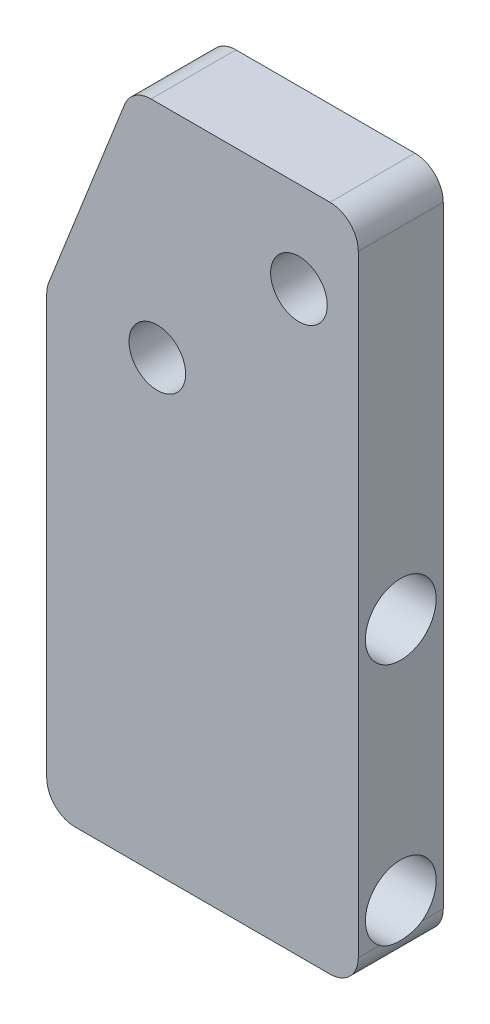
ISO-10303-21;
HEADER;
FILE_DESCRIPTION(('STEP AP214'),'2;1');
FILE_NAME('part.step','',(''),(''),'','','');
FILE_SCHEMA(('AUTOMOTIVE_DESIGN { 1 0 10303 214 1 1 1 1 }'));
ENDSEC;
DATA;
#1=APPLICATION_CONTEXT('core data for automotive mechanical design processes');
#2=APPLICATION_PROTOCOL_DEFINITION('international standard','automotive_design',2000,#1);
#3=PRODUCT_CONTEXT('',#1,'mechanical');
#4=PRODUCT('Part','Part','',(#3));
#5=PRODUCT_RELATED_PRODUCT_CATEGORY('part','',(#4));
#6=PRODUCT_DEFINITION_FORMATION('','',#4);
#7=PRODUCT_DEFINITION_CONTEXT('part definition',#1,'design');
#8=PRODUCT_DEFINITION('design','',#6,#7);
#9=PRODUCT_DEFINITION_SHAPE('','',#8);
#10=(LENGTH_UNIT() NAMED_UNIT(*) SI_UNIT(.MILLI.,.METRE.));
#11=(NAMED_UNIT(*) PLANE_ANGLE_UNIT() SI_UNIT($,.RADIAN.));
#12=(NAMED_UNIT(*) SI_UNIT($,.STERADIAN.) SOLID_ANGLE_UNIT());
#13=UNCERTAINTY_MEASURE_WITH_UNIT(LENGTH_MEASURE(1.E-05),#10,'distance_accuracy_value','');
#14=(GEOMETRIC_REPRESENTATION_CONTEXT(3) GLOBAL_UNCERTAINTY_ASSIGNED_CONTEXT((#13)) GLOBAL_UNIT_ASSIGNED_CONTEXT((#10,
#11,#12)) REPRESENTATION_CONTEXT('',''));
#15=CARTESIAN_POINT('',(0.,0.,0.));
#16=DIRECTION('',(0.,0.,1.));
#17=DIRECTION('',(1.,0.,0.));
#18=AXIS2_PLACEMENT_3D('',#15,#16,#17);
#19=CARTESIAN_POINT('',(-50.8,0.,19.05));
#20=DIRECTION('',(0.,-1.,0.));
#21=DIRECTION('',(0.,0.,-1.));
#22=AXIS2_PLACEMENT_3D('',#19,#20,#21);
#23=PLANE('',#22);
#24=DIRECTION('',(-1.,0.,0.));
#25=VECTOR('',#24,1.);
#26=CARTESIAN_POINT('',(-50.8,0.,0.));
#27=LINE('',#26,#25);
#28=CARTESIAN_POINT('',(-6.35000000000001,0.,0.));
#29=VERTEX_POINT('',#28);
#30=CARTESIAN_POINT('',(-46.4797613857669,0.,0.));
#31=VERTEX_POINT('',#30);
#32=EDGE_CURVE('E142',#29,#31,#27,.T.);
#33=ORIENTED_EDGE('',*,*,#32,.T.);
#34=DIRECTION('',(0.,0.,-1.));
#35=VECTOR('',#34,1.);
#36=CARTESIAN_POINT('',(-46.4797613857669,0.,19.05));
#37=LINE('',#36,#35);
#38=CARTESIAN_POINT('',(-46.4797613857669,0.,19.05));
#39=VERTEX_POINT('',#38);
#40=EDGE_CURVE('E120',#31,#39,#37,.F.);
#41=ORIENTED_EDGE('',*,*,#40,.T.);
#42=DIRECTION('',(-1.,0.,0.));
#43=VECTOR('',#42,1.);
#44=CARTESIAN_POINT('',(-50.8,0.,19.05));
#45=LINE('',#44,#43);
#46=CARTESIAN_POINT('',(-6.35000000000001,0.,19.05));
#47=VERTEX_POINT('',#46);
#48=EDGE_CURVE('E156',#47,#39,#45,.T.);
#49=ORIENTED_EDGE('',*,*,#48,.F.);
#50=DIRECTION('',(0.,0.,-1.));
#51=VECTOR('',#50,1.);
#52=CARTESIAN_POINT('',(-6.35000000000001,0.,19.05));
#53=LINE('',#52,#51);
#54=EDGE_CURVE('E125',#47,#29,#53,.T.);
#55=ORIENTED_EDGE('',*,*,#54,.T.);
#56=EDGE_LOOP('',(#33,#41,#49,#55));
#57=FACE_BOUND('',#56,.T.);
#58=ADVANCED_FACE('F33',(#57),#23,.F.);
#59=CARTESIAN_POINT('',(-69.85,-48.26,19.05));
#60=DIRECTION('',(0.930155221331323,-0.367166534736048,0.));
#61=DIRECTION('',(0.367166534736048,0.930155221331323,0.));
#62=AXIS2_PLACEMENT_3D('',#59,#60,#61);
#63=PLANE('',#62);
#64=DIRECTION('',(-0.367166534736048,-0.930155221331323,0.));
#65=VECTOR('',#64,1.);
#66=CARTESIAN_POINT('',(-69.85,-48.26,19.05));
#67=LINE('',#66,#65);
#68=CARTESIAN_POINT('',(-52.3862470412208,-4.01849250442609,19.05));
#69=VERTEX_POINT('',#68);
#70=CARTESIAN_POINT('',(-69.4064856554539,-47.1364303271499,19.05));
#71=VERTEX_POINT('',#70);
#72=EDGE_CURVE('E135',#69,#71,#67,.T.);
#73=ORIENTED_EDGE('',*,*,#72,.F.);
#74=DIRECTION('',(0.,0.,-1.));
#75=VECTOR('',#74,1.);
#76=CARTESIAN_POINT('',(-52.3862470412208,-4.0184925044261,19.05));
#77=LINE('',#76,#75);
#78=CARTESIAN_POINT('',(-52.3862470412208,-4.01849250442609,0.));
#79=VERTEX_POINT('',#78);
#80=EDGE_CURVE('E119',#69,#79,#77,.T.);
#81=ORIENTED_EDGE('',*,*,#80,.T.);
#82=DIRECTION('',(-0.367166534736048,-0.930155221331323,0.));
#83=VECTOR('',#82,1.);
#84=CARTESIAN_POINT('',(-69.85,-48.26,0.));
#85=LINE('',#84,#83);
#86=CARTESIAN_POINT('',(-69.4064856554539,-47.1364303271499,0.));
#87=VERTEX_POINT('',#86);
#88=EDGE_CURVE('E132',#79,#87,#85,.T.);
#89=ORIENTED_EDGE('',*,*,#88,.T.);
#90=DIRECTION('',(0.,0.,-1.));
#91=VECTOR('',#90,1.);
#92=CARTESIAN_POINT('',(-69.4064856554539,-47.1364303271499,19.05));
#93=LINE('',#92,#91);
#94=EDGE_CURVE('E137',#87,#71,#93,.F.);
#95=ORIENTED_EDGE('',*,*,#94,.T.);
#96=EDGE_LOOP('',(#73,#81,#89,#95));
#97=FACE_BOUND('',#96,.T.);
#98=ADVANCED_FACE('F131',(#97),#63,.F.);
#99=CARTESIAN_POINT('',(-69.85,-149.86,19.05));
#100=DIRECTION('',(1.,0.,0.));
#101=DIRECTION('',(0.,0.,-1.));
#102=AXIS2_PLACEMENT_3D('',#99,#100,#101);
#103=PLANE('',#102);
#104=DIRECTION('',(0.,-1.,0.));
#105=VECTOR('',#104,1.);
#106=CARTESIAN_POINT('',(-69.85,-149.86,0.));
#107=LINE('',#106,#105);
#108=CARTESIAN_POINT('',(-69.85,-49.4679378227238,0.));
#109=VERTEX_POINT('',#108);
#110=CARTESIAN_POINT('',(-69.85,-143.51,0.));
#111=VERTEX_POINT('',#110);
#112=EDGE_CURVE('E141',#109,#111,#107,.T.);
#113=ORIENTED_EDGE('',*,*,#112,.T.);
#114=DIRECTION('',(0.,0.,-1.));
#115=VECTOR('',#114,1.);
#116=CARTESIAN_POINT('',(-69.85,-143.51,19.05));
#117=LINE('',#116,#115);
#118=CARTESIAN_POINT('',(-69.85,-143.51,19.05));
#119=VERTEX_POINT('',#118);
#120=EDGE_CURVE('E11',#111,#119,#117,.F.);
#121=ORIENTED_EDGE('',*,*,#120,.T.);
#122=DIRECTION('',(0.,-1.,0.));
#123=VECTOR('',#122,1.);
#124=CARTESIAN_POINT('',(-69.85,-149.86,19.05));
#125=LINE('',#124,#123);
#126=CARTESIAN_POINT('',(-69.85,-49.4679378227238,19.05));
#127=VERTEX_POINT('',#126);
#128=EDGE_CURVE('E245',#127,#119,#125,.T.);
#129=ORIENTED_EDGE('',*,*,#128,.F.);
#130=DIRECTION('',(0.,0.,-1.));
#131=VECTOR('',#130,1.);
#132=CARTESIAN_POINT('',(-69.85,-49.4679378227238,19.05));
#133=LINE('',#132,#131);
#134=EDGE_CURVE('E41',#127,#109,#133,.T.);
#135=ORIENTED_EDGE('',*,*,#134,.T.);
#136=EDGE_LOOP('',(#113,#121,#129,#135));
#137=FACE_BOUND('',#136,.T.);
#138=ADVANCED_FACE('F217',(#137),#103,.F.);
#139=CARTESIAN_POINT('',(0.,-149.86,19.05));
#140=DIRECTION('',(0.,1.,0.));
#141=DIRECTION('',(0.,0.,1.));
#142=AXIS2_PLACEMENT_3D('',#139,#140,#141);
#143=PLANE('',#142);
#144=DIRECTION('',(1.,0.,0.));
#145=VECTOR('',#144,1.);
#146=CARTESIAN_POINT('',(0.,-149.86,0.));
#147=LINE('',#146,#145);
#148=CARTESIAN_POINT('',(-63.5,-149.86,0.));
#149=VERTEX_POINT('',#148);
#150=CARTESIAN_POINT('',(-6.34999999999998,-149.86,0.));
#151=VERTEX_POINT('',#150);
#152=EDGE_CURVE('E145',#149,#151,#147,.T.);
#153=ORIENTED_EDGE('',*,*,#152,.T.);
#154=DIRECTION('',(0.,0.,-1.));
#155=VECTOR('',#154,1.);
#156=CARTESIAN_POINT('',(-6.34999999999998,-149.86,19.05));
#157=LINE('',#156,#155);
#158=CARTESIAN_POINT('',(-6.34999999999998,-149.86,19.05));
#159=VERTEX_POINT('',#158);
#160=EDGE_CURVE('E262',#151,#159,#157,.F.);
#161=ORIENTED_EDGE('',*,*,#160,.T.);
#162=DIRECTION('',(1.,0.,0.));
#163=VECTOR('',#162,1.);
#164=CARTESIAN_POINT('',(0.,-149.86,19.05));
#165=LINE('',#164,#163);
#166=CARTESIAN_POINT('',(-63.5,-149.86,19.05));
#167=VERTEX_POINT('',#166);
#168=EDGE_CURVE('E253',#167,#159,#165,.T.);
#169=ORIENTED_EDGE('',*,*,#168,.F.);
#170=DIRECTION('',(0.,0.,-1.));
#171=VECTOR('',#170,1.);
#172=CARTESIAN_POINT('',(-63.5,-149.86,19.05));
#173=LINE('',#172,#171);
#174=EDGE_CURVE('E190',#167,#149,#173,.T.);
#175=ORIENTED_EDGE('',*,*,#174,.T.);
#176=EDGE_LOOP('',(#153,#161,#169,#175));
#177=FACE_BOUND('',#176,.T.);
#178=ADVANCED_FACE('F213',(#177),#143,.F.);
#179=CARTESIAN_POINT('',(0.,0.,19.05));
#180=DIRECTION('',(-1.,0.,0.));
#181=DIRECTION('',(0.,-1.,0.));
#182=AXIS2_PLACEMENT_3D('',#179,#180,#181);
#183=PLANE('',#182);
#184=CARTESIAN_POINT('',(0.,-82.55,9.525));
#185=DIRECTION('',(1.,0.,0.));
#186=DIRECTION('',(0.,0.,-1.));
#187=AXIS2_PLACEMENT_3D('',#184,#185,#186);
#188=CIRCLE('',#187,7.9375);
#189=CARTESIAN_POINT('',(0.,-82.55,1.5875));
#190=VERTEX_POINT('',#189);
#191=EDGE_CURVE('E267',#190,#190,#188,.T.);
#192=ORIENTED_EDGE('',*,*,#191,.F.);
#193=EDGE_LOOP('',(#192));
#194=FACE_BOUND('',#193,.T.);
#195=DIRECTION('',(0.,1.,0.));
#196=VECTOR('',#195,1.);
#197=CARTESIAN_POINT('',(0.,0.,0.));
#198=LINE('',#197,#196);
#199=CARTESIAN_POINT('',(0.,-143.51,0.));
#200=VERTEX_POINT('',#199);
#201=CARTESIAN_POINT('',(0.,-6.35,0.));
#202=VERTEX_POINT('',#201);
#203=EDGE_CURVE('E153',#200,#202,#198,.T.);
#204=ORIENTED_EDGE('',*,*,#203,.T.);
#205=DIRECTION('',(0.,0.,-1.));
#206=VECTOR('',#205,1.);
#207=CARTESIAN_POINT('',(0.,-6.35,19.05));
#208=LINE('',#207,#206);
#209=CARTESIAN_POINT('',(0.,-6.35,19.05));
#210=VERTEX_POINT('',#209);
#211=EDGE_CURVE('E182',#202,#210,#208,.F.);
#212=ORIENTED_EDGE('',*,*,#211,.T.);
#213=DIRECTION('',(0.,1.,0.));
#214=VECTOR('',#213,1.);
#215=CARTESIAN_POINT('',(0.,0.,19.05));
#216=LINE('',#215,#214);
#217=CARTESIAN_POINT('',(0.,-143.51,19.05));
#218=VERTEX_POINT('',#217);
#219=EDGE_CURVE('E157',#218,#210,#216,.T.);
#220=ORIENTED_EDGE('',*,*,#219,.F.);
#221=DIRECTION('',(0.,0.,-1.));
#222=VECTOR('',#221,1.);
#223=CARTESIAN_POINT('',(0.,-143.51,19.05));
#224=LINE('',#223,#222);
#225=CARTESIAN_POINT('',(0.,-143.51,14.2875000000001));
#226=VERTEX_POINT('',#225);
#227=EDGE_CURVE('E180',#218,#226,#224,.T.);
#228=ORIENTED_EDGE('',*,*,#227,.T.);
#229=CARTESIAN_POINT('',(0.,-137.16,9.525));
#230=DIRECTION('',(1.,0.,0.));
#231=DIRECTION('',(0.,0.,-1.));
#232=AXIS2_PLACEMENT_3D('',#229,#230,#231);
#233=CIRCLE('',#232,7.93750000000001);
#234=CARTESIAN_POINT('',(0.,-143.51,4.76249999999994));
#235=VERTEX_POINT('',#234);
#236=EDGE_CURVE('E248',#235,#226,#233,.T.);
#237=ORIENTED_EDGE('',*,*,#236,.F.);
#238=DIRECTION('',(0.,0.,-1.));
#239=VECTOR('',#238,1.);
#240=CARTESIAN_POINT('',(0.,-143.51,19.05));
#241=LINE('',#240,#239);
#242=EDGE_CURVE('E178',#235,#200,#241,.T.);
#243=ORIENTED_EDGE('',*,*,#242,.T.);
#244=EDGE_LOOP('',(#204,#212,#220,#228,#237,#243));
#245=FACE_BOUND('',#244,.T.);
#246=ADVANCED_FACE('F206',(#194,#245),#183,.F.);
#247=CARTESIAN_POINT('',(0.,0.,19.05));
#248=DIRECTION('',(0.,0.,-1.));
#249=DIRECTION('',(-1.,0.,0.));
#250=AXIS2_PLACEMENT_3D('',#247,#248,#249);
#251=PLANE('',#250);
#252=CARTESIAN_POINT('',(-45.0596,-49.53,19.05));
#253=DIRECTION('',(0.,0.,1.));
#254=DIRECTION('',(1.,0.,0.));
#255=AXIS2_PLACEMENT_3D('',#252,#253,#254);
#256=CIRCLE('',#255,6.35);
#257=CARTESIAN_POINT('',(-38.7096,-49.53,19.05));
#258=VERTEX_POINT('',#257);
#259=EDGE_CURVE('E269',#258,#258,#256,.T.);
#260=ORIENTED_EDGE('',*,*,#259,.F.);
#261=EDGE_LOOP('',(#260));
#262=FACE_BOUND('',#261,.T.);
#263=CARTESIAN_POINT('',(-13.3096,-20.32,19.05));
#264=DIRECTION('',(0.,0.,1.));
#265=DIRECTION('',(1.,0.,0.));
#266=AXIS2_PLACEMENT_3D('',#263,#264,#265);
#267=CIRCLE('',#266,6.35000000000001);
#268=CARTESIAN_POINT('',(-6.95959999999998,-20.32,19.05));
#269=VERTEX_POINT('',#268);
#270=EDGE_CURVE('E278',#269,#269,#267,.T.);
#271=ORIENTED_EDGE('',*,*,#270,.F.);
#272=EDGE_LOOP('',(#271));
#273=FACE_BOUND('',#272,.T.);
#274=ORIENTED_EDGE('',*,*,#48,.T.);
#275=CARTESIAN_POINT('',(-46.4797613857669,-6.35,19.05));
#276=DIRECTION('',(0.,0.,-1.));
#277=DIRECTION('',(-1.,0.,0.));
#278=AXIS2_PLACEMENT_3D('',#275,#276,#277);
#279=CIRCLE('',#278,6.35);
#280=EDGE_CURVE('E176',#39,#69,#279,.F.);
#281=ORIENTED_EDGE('',*,*,#280,.T.);
#282=ORIENTED_EDGE('',*,*,#72,.T.);
#283=CARTESIAN_POINT('',(-63.5,-49.4679378227238,19.05));
#284=DIRECTION('',(0.,0.,-1.));
#285=DIRECTION('',(-1.,0.,0.));
#286=AXIS2_PLACEMENT_3D('',#283,#284,#285);
#287=CIRCLE('',#286,6.35);
#288=EDGE_CURVE('E168',#71,#127,#287,.F.);
#289=ORIENTED_EDGE('',*,*,#288,.T.);
#290=ORIENTED_EDGE('',*,*,#128,.T.);
#291=CARTESIAN_POINT('',(-63.5,-143.51,19.05));
#292=DIRECTION('',(0.,0.,-1.));
#293=DIRECTION('',(-1.,0.,0.));
#294=AXIS2_PLACEMENT_3D('',#291,#292,#293);
#295=CIRCLE('',#294,6.35);
#296=EDGE_CURVE('E170',#119,#167,#295,.F.);
#297=ORIENTED_EDGE('',*,*,#296,.T.);
#298=ORIENTED_EDGE('',*,*,#168,.T.);
#299=CARTESIAN_POINT('',(-6.34999999999998,-143.51,19.05));
#300=DIRECTION('',(0.,0.,-1.));
#301=DIRECTION('',(-1.,0.,0.));
#302=AXIS2_PLACEMENT_3D('',#299,#300,#301);
#303=CIRCLE('',#302,6.35);
#304=EDGE_CURVE('E172',#159,#218,#303,.F.);
#305=ORIENTED_EDGE('',*,*,#304,.T.);
#306=ORIENTED_EDGE('',*,*,#219,.T.);
#307=CARTESIAN_POINT('',(-6.35000000000001,-6.35,19.05));
#308=DIRECTION('',(0.,0.,-1.));
#309=DIRECTION('',(-1.,0.,0.));
#310=AXIS2_PLACEMENT_3D('',#307,#308,#309);
#311=CIRCLE('',#310,6.35);
#312=EDGE_CURVE('E174',#210,#47,#311,.F.);
#313=ORIENTED_EDGE('',*,*,#312,.T.);
#314=EDGE_LOOP('',(#274,#281,#282,#289,#290,#297,#298,#305,#306,#313));
#315=FACE_BOUND('',#314,.T.);
#316=ADVANCED_FACE('F203',(#262,#273,#315),#251,.F.);
#317=CARTESIAN_POINT('',(0.,0.,0.));
#318=DIRECTION('',(0.,0.,-1.));
#319=DIRECTION('',(-1.,0.,0.));
#320=AXIS2_PLACEMENT_3D('',#317,#318,#319);
#321=PLANE('',#320);
#322=CARTESIAN_POINT('',(-45.0596,-49.53,0.));
#323=DIRECTION('',(0.,0.,1.));
#324=DIRECTION('',(1.,0.,0.));
#325=AXIS2_PLACEMENT_3D('',#322,#323,#324);
#326=CIRCLE('',#325,6.35);
#327=CARTESIAN_POINT('',(-38.7096,-49.53,0.));
#328=VERTEX_POINT('',#327);
#329=EDGE_CURVE('E265',#328,#328,#326,.T.);
#330=ORIENTED_EDGE('',*,*,#329,.T.);
#331=EDGE_LOOP('',(#330));
#332=FACE_BOUND('',#331,.T.);
#333=CARTESIAN_POINT('',(-13.3096,-20.32,0.));
#334=DIRECTION('',(0.,0.,1.));
#335=DIRECTION('',(1.,0.,0.));
#336=AXIS2_PLACEMENT_3D('',#333,#334,#335);
#337=CIRCLE('',#336,6.35000000000001);
#338=CARTESIAN_POINT('',(-6.95959999999998,-20.32,0.));
#339=VERTEX_POINT('',#338);
#340=EDGE_CURVE('E273',#339,#339,#337,.T.);
#341=ORIENTED_EDGE('',*,*,#340,.T.);
#342=EDGE_LOOP('',(#341));
#343=FACE_BOUND('',#342,.T.);
#344=ORIENTED_EDGE('',*,*,#88,.F.);
#345=CARTESIAN_POINT('',(-46.4797613857669,-6.35,0.));
#346=DIRECTION('',(0.,0.,-1.));
#347=DIRECTION('',(-1.,0.,0.));
#348=AXIS2_PLACEMENT_3D('',#345,#346,#347);
#349=CIRCLE('',#348,6.35);
#350=EDGE_CURVE('E115',#79,#31,#349,.T.);
#351=ORIENTED_EDGE('',*,*,#350,.T.);
#352=ORIENTED_EDGE('',*,*,#32,.F.);
#353=CARTESIAN_POINT('',(-6.35000000000001,-6.35,0.));
#354=DIRECTION('',(0.,0.,-1.));
#355=DIRECTION('',(-1.,0.,0.));
#356=AXIS2_PLACEMENT_3D('',#353,#354,#355);
#357=CIRCLE('',#356,6.35);
#358=EDGE_CURVE('E126',#29,#202,#357,.T.);
#359=ORIENTED_EDGE('',*,*,#358,.T.);
#360=ORIENTED_EDGE('',*,*,#203,.F.);
#361=CARTESIAN_POINT('',(-6.34999999999998,-143.51,0.));
#362=DIRECTION('',(0.,0.,-1.));
#363=DIRECTION('',(-1.,0.,0.));
#364=AXIS2_PLACEMENT_3D('',#361,#362,#363);
#365=CIRCLE('',#364,6.35);
#366=EDGE_CURVE('E162',#200,#151,#365,.T.);
#367=ORIENTED_EDGE('',*,*,#366,.T.);
#368=ORIENTED_EDGE('',*,*,#152,.F.);
#369=CARTESIAN_POINT('',(-63.5,-143.51,0.));
#370=DIRECTION('',(0.,0.,-1.));
#371=DIRECTION('',(-1.,0.,0.));
#372=AXIS2_PLACEMENT_3D('',#369,#370,#371);
#373=CIRCLE('',#372,6.35);
#374=EDGE_CURVE('E160',#149,#111,#373,.T.);
#375=ORIENTED_EDGE('',*,*,#374,.T.);
#376=ORIENTED_EDGE('',*,*,#112,.F.);
#377=CARTESIAN_POINT('',(-63.5,-49.4679378227238,0.));
#378=DIRECTION('',(0.,0.,-1.));
#379=DIRECTION('',(-1.,0.,0.));
#380=AXIS2_PLACEMENT_3D('',#377,#378,#379);
#381=CIRCLE('',#380,6.35);
#382=EDGE_CURVE('E136',#109,#87,#381,.T.);
#383=ORIENTED_EDGE('',*,*,#382,.T.);
#384=EDGE_LOOP('',(#344,#351,#352,#359,#360,#367,#368,#375,#376,#383));
#385=FACE_BOUND('',#384,.T.);
#386=ADVANCED_FACE('F139',(#332,#343,#385),#321,.T.);
#387=CARTESIAN_POINT('',(-15.24,-137.16,9.525));
#388=DIRECTION('',(1.,0.,0.));
#389=DIRECTION('',(0.,0.,-1.));
#390=AXIS2_PLACEMENT_3D('',#387,#388,#389);
#391=CYLINDRICAL_SURFACE('',#390,7.93750000000001);
#392=CARTESIAN_POINT('',(-15.24,-137.16,9.525));
#393=DIRECTION('',(1.,0.,0.));
#394=DIRECTION('',(0.,0.,-1.));
#395=AXIS2_PLACEMENT_3D('',#392,#393,#394);
#396=CIRCLE('',#395,7.93750000000001);
#397=CARTESIAN_POINT('',(-15.24,-137.16,1.58749999999999));
#398=VERTEX_POINT('',#397);
#399=EDGE_CURVE('E264',#398,#398,#396,.T.);
#400=ORIENTED_EDGE('',*,*,#399,.F.);
#401=EDGE_LOOP('',(#400));
#402=FACE_BOUND('',#401,.T.);
#403=ORIENTED_EDGE('',*,*,#236,.T.);
#404=CARTESIAN_POINT('',(0.,-143.51,14.2875000000001));
#405=CARTESIAN_POINT('',(-3.44369659539257E-05,-143.642536186943,14.1108252005884));
#406=CARTESIAN_POINT('',(-0.00414976258488821,-143.767610469502,13.928657903944));
#407=CARTESIAN_POINT('',(-0.0179940706033077,-144.002031418874,13.5547730810565));
#408=CARTESIAN_POINT('',(-0.0277205398448881,-144.111385099366,13.3630598654057));
#409=CARTESIAN_POINT('',(-0.0502524148812657,-144.313760173317,12.9712041278514));
#410=CARTESIAN_POINT('',(-0.0630602244612766,-144.406768717257,12.771055126148));
#411=CARTESIAN_POINT('',(-0.0894968024420439,-144.575799715155,12.3637383759874));
#412=CARTESIAN_POINT('',(-0.103125651724309,-144.651820492145,12.1565699369203));
#413=CARTESIAN_POINT('',(-0.129218492774142,-144.786351848128,11.73662013719));
#414=CARTESIAN_POINT('',(-0.14168284408831,-144.84486784421,11.5238405352026));
#415=CARTESIAN_POINT('',(-0.16382888465419,-144.944005662014,11.0940128038307));
#416=CARTESIAN_POINT('',(-0.173510687111791,-144.984628211752,10.8769648484848));
#417=CARTESIAN_POINT('',(-0.188890664730627,-145.04762336953,10.4403629454708));
#418=CARTESIAN_POINT('',(-0.19459370720049,-145.07001828147,10.2208123948039));
#419=CARTESIAN_POINT('',(-0.201352610691082,-145.096450055665,9.78053729918798));
#420=CARTESIAN_POINT('',(-0.202408539522986,-145.100487185799,9.55981277141681));
#421=CARTESIAN_POINT('',(-0.199757153640529,-145.090202232469,9.12026232648755));
#422=CARTESIAN_POINT('',(-0.196080826158967,-145.075999586075,8.90143340848484));
#423=CARTESIAN_POINT('',(-0.184450467309995,-145.029562079755,8.46581055025538));
#424=CARTESIAN_POINT('',(-0.176496323814706,-144.997326747164,8.24901666352137));
#425=CARTESIAN_POINT('',(-0.157251768333759,-144.915044899653,7.81877417491315));
#426=CARTESIAN_POINT('',(-0.145958091966857,-144.864980947491,7.6053290624397));
#427=CARTESIAN_POINT('',(-0.121444151532684,-144.747414282074,7.18341840537624));
#428=CARTESIAN_POINT('',(-0.108223973693764,-144.679912349221,6.97495263840133));
#429=CARTESIAN_POINT('',(-0.0833315690905217,-144.537567098085,6.59038690496283));
#430=CARTESIAN_POINT('',(-0.0716757025503444,-144.464741107551,6.41353566321931));
#431=CARTESIAN_POINT('',(-0.0496449227174874,-144.306494225554,6.06551141135136));
#432=CARTESIAN_POINT('',(-0.0392697609635036,-144.221075784151,5.89433730456983));
#433=CARTESIAN_POINT('',(-0.0213354398683445,-144.038157483597,5.55872903477563));
#434=CARTESIAN_POINT('',(-0.0137721826433725,-143.940675483623,5.39428537697624));
#435=CARTESIAN_POINT('',(-0.00311275890815958,-143.733994182021,5.0726835041843));
#436=CARTESIAN_POINT('',(-1.86583923561734E-05,-143.624789486289,4.91552869113696));
#437=CARTESIAN_POINT('',(0.,-143.51,4.76249999999994));
#438=B_SPLINE_CURVE_WITH_KNOTS('',3,(#404,#405,#406,#407,#408,#409,#410,#411,#412,#413,#414,
#415,#416,#417,#418,#419,#420,#421,#422,#423,#424,#425,#426,#427,#428,#429,#430,#431,#432,#433,
#434,#435,#436,#437),.UNSPECIFIED.,.F.,.F.,(4,2,2,2,2,2,2,2,2,2,2,2,2,2,2,2,4),(0.,
0.662238198725864,1.32418001964152,1.98663991221459,2.64916517148288,3.31148519086149,
3.97377826043703,4.63525970424038,5.29673149560434,5.95389386506592,6.61107346056394,
7.26889758233349,7.92669226956654,8.50104826461327,9.07529265683374,9.64869687200624,
10.2223660747974),.UNSPECIFIED.);
#439=EDGE_CURVE('E47',#226,#235,#438,.T.);
#440=ORIENTED_EDGE('',*,*,#439,.T.);
#441=EDGE_LOOP('',(#403,#440));
#442=FACE_BOUND('',#441,.T.);
#443=ADVANCED_FACE('F195',(#402,#442),#391,.F.);
#444=CARTESIAN_POINT('',(-15.24,-137.16,9.525));
#445=DIRECTION('',(1.,0.,0.));
#446=DIRECTION('',(0.,0.,-1.));
#447=AXIS2_PLACEMENT_3D('',#444,#445,#446);
#448=PLANE('',#447);
#449=ORIENTED_EDGE('',*,*,#399,.T.);
#450=EDGE_LOOP('',(#449));
#451=FACE_BOUND('',#450,.T.);
#452=ADVANCED_FACE('F200',(#451),#448,.T.);
#453=CARTESIAN_POINT('',(-15.24,-82.55,9.525));
#454=DIRECTION('',(1.,0.,0.));
#455=DIRECTION('',(0.,0.,-1.));
#456=AXIS2_PLACEMENT_3D('',#453,#454,#455);
#457=CYLINDRICAL_SURFACE('',#456,7.9375);
#458=CARTESIAN_POINT('',(-15.24,-82.55,9.525));
#459=DIRECTION('',(1.,0.,0.));
#460=DIRECTION('',(0.,0.,-1.));
#461=AXIS2_PLACEMENT_3D('',#458,#459,#460);
#462=CIRCLE('',#461,7.9375);
#463=CARTESIAN_POINT('',(-15.24,-82.55,1.5875));
#464=VERTEX_POINT('',#463);
#465=EDGE_CURVE('E147',#464,#464,#462,.T.);
#466=CARTESIAN_POINT('',(-15.24,-82.55,1.5875));
#467=CARTESIAN_POINT('',(-15.08125,-82.55,1.5875));
#468=CARTESIAN_POINT('',(-14.9225,-82.55,1.5875));
#469=CARTESIAN_POINT('',(-14.605,-82.55,1.5875));
#470=CARTESIAN_POINT('',(-14.44625,-82.55,1.5875));
#471=CARTESIAN_POINT('',(-14.12875,-82.55,1.5875));
#472=CARTESIAN_POINT('',(-13.97,-82.55,1.5875));
#473=CARTESIAN_POINT('',(-13.6525,-82.55,1.5875));
#474=CARTESIAN_POINT('',(-13.49375,-82.55,1.5875));
#475=CARTESIAN_POINT('',(-13.17625,-82.55,1.5875));
#476=CARTESIAN_POINT('',(-13.0175,-82.55,1.5875));
#477=CARTESIAN_POINT('',(-12.7,-82.55,1.5875));
#478=CARTESIAN_POINT('',(-12.54125,-82.55,1.5875));
#479=CARTESIAN_POINT('',(-12.22375,-82.55,1.5875));
#480=CARTESIAN_POINT('',(-12.065,-82.55,1.5875));
#481=CARTESIAN_POINT('',(-11.7475,-82.55,1.5875));
#482=CARTESIAN_POINT('',(-11.58875,-82.55,1.5875));
#483=CARTESIAN_POINT('',(-11.27125,-82.55,1.5875));
#484=CARTESIAN_POINT('',(-11.1125,-82.55,1.5875));
#485=CARTESIAN_POINT('',(-10.795,-82.55,1.5875));
#486=CARTESIAN_POINT('',(-10.63625,-82.55,1.5875));
#487=CARTESIAN_POINT('',(-10.31875,-82.55,1.5875));
#488=CARTESIAN_POINT('',(-10.16,-82.55,1.5875));
#489=CARTESIAN_POINT('',(-9.8425,-82.55,1.5875));
#490=CARTESIAN_POINT('',(-9.68375,-82.55,1.5875));
#491=CARTESIAN_POINT('',(-9.36625,-82.55,1.5875));
#492=CARTESIAN_POINT('',(-9.2075,-82.55,1.5875));
#493=CARTESIAN_POINT('',(-8.89,-82.55,1.5875));
#494=CARTESIAN_POINT('',(-8.73125,-82.55,1.5875));
#495=CARTESIAN_POINT('',(-8.41375,-82.55,1.5875));
#496=CARTESIAN_POINT('',(-8.255,-82.55,1.5875));
#497=CARTESIAN_POINT('',(-7.9375,-82.55,1.5875));
#498=CARTESIAN_POINT('',(-7.77875,-82.55,1.5875));
#499=CARTESIAN_POINT('',(-7.46125,-82.55,1.5875));
#500=CARTESIAN_POINT('',(-7.3025,-82.55,1.5875));
#501=CARTESIAN_POINT('',(-6.985,-82.55,1.5875));
#502=CARTESIAN_POINT('',(-6.82625,-82.55,1.5875));
#503=CARTESIAN_POINT('',(-6.50875,-82.55,1.5875));
#504=CARTESIAN_POINT('',(-6.35,-82.55,1.5875));
#505=CARTESIAN_POINT('',(-6.0325,-82.55,1.5875));
#506=CARTESIAN_POINT('',(-5.87375,-82.55,1.5875));
#507=CARTESIAN_POINT('',(-5.55625,-82.55,1.5875));
#508=CARTESIAN_POINT('',(-5.3975,-82.55,1.5875));
#509=CARTESIAN_POINT('',(-5.08,-82.55,1.5875));
#510=CARTESIAN_POINT('',(-4.92125,-82.55,1.5875));
#511=CARTESIAN_POINT('',(-4.60375,-82.55,1.5875));
#512=CARTESIAN_POINT('',(-4.445,-82.55,1.5875));
#513=CARTESIAN_POINT('',(-4.1275,-82.55,1.5875));
#514=CARTESIAN_POINT('',(-3.96875,-82.55,1.5875));
#515=CARTESIAN_POINT('',(-3.65125,-82.55,1.5875));
#516=CARTESIAN_POINT('',(-3.4925,-82.55,1.5875));
#517=CARTESIAN_POINT('',(-3.175,-82.55,1.5875));
#518=CARTESIAN_POINT('',(-3.01625,-82.55,1.5875));
#519=CARTESIAN_POINT('',(-2.69875,-82.55,1.5875));
#520=CARTESIAN_POINT('',(-2.54,-82.55,1.5875));
#521=CARTESIAN_POINT('',(-2.2225,-82.55,1.5875));
#522=CARTESIAN_POINT('',(-2.06375,-82.55,1.5875));
#523=CARTESIAN_POINT('',(-1.74625,-82.55,1.5875));
#524=CARTESIAN_POINT('',(-1.5875,-82.55,1.5875));
#525=CARTESIAN_POINT('',(-1.27,-82.55,1.5875));
#526=CARTESIAN_POINT('',(-1.11125,-82.55,1.5875));
#527=CARTESIAN_POINT('',(-0.79375,-82.55,1.5875));
#528=CARTESIAN_POINT('',(-0.634999999999999,-82.55,1.5875));
#529=CARTESIAN_POINT('',(-0.3175,-82.55,1.5875));
#530=CARTESIAN_POINT('',(-0.15875,-82.55,1.5875));
#531=CARTESIAN_POINT('',(0.,-82.55,1.5875));
#532=B_SPLINE_CURVE_WITH_KNOTS('',3,(#466,#467,#468,#469,#470,#471,#472,#473,#474,#475,#476,
#477,#478,#479,#480,#481,#482,#483,#484,#485,#486,#487,#488,#489,#490,#491,#492,#493,#494,#495,
#496,#497,#498,#499,#500,#501,#502,#503,#504,#505,#506,#507,#508,#509,#510,#511,#512,#513,#514,
#515,#516,#517,#518,#519,#520,#521,#522,#523,#524,#525,#526,#527,#528,#529,#530,#531),
.UNSPECIFIED.,.F.,.F.,(4,2,2,2,2,2,2,2,2,2,2,2,2,2,2,2,2,2,2,2,2,2,2,2,2,2,2,2,2,2,2,2,4),(0.,
0.476250000000001,0.9525,1.42875,1.905,2.38125,2.8575,3.33375,3.81,4.28625,4.7625,5.23875,5.715,
6.19125,6.6675,7.14375,7.62,8.09625,8.5725,9.04875,9.525,10.00125,10.4775,10.95375,11.43,
11.90625,12.3825,12.85875,13.335,13.81125,14.2875,14.76375,15.24),.UNSPECIFIED.);
#533=EDGE_CURVE('BSEAM286',#464,#190,#532,.T.);
#534=ORIENTED_EDGE('',*,*,#465,.F.);
#535=ORIENTED_EDGE('',*,*,#191,.T.);
#536=ORIENTED_EDGE('',*,*,#533,.T.);
#537=ORIENTED_EDGE('',*,*,#533,.F.);
#538=EDGE_LOOP('',(#534,#536,#535,#537));
#539=FACE_BOUND('',#538,.T.);
#540=ADVANCED_FACE('F286',(#539),#457,.F.);
#541=CARTESIAN_POINT('',(-15.24,-82.55,9.525));
#542=DIRECTION('',(1.,0.,0.));
#543=DIRECTION('',(0.,0.,-1.));
#544=AXIS2_PLACEMENT_3D('',#541,#542,#543);
#545=PLANE('',#544);
#546=ORIENTED_EDGE('',*,*,#465,.T.);
#547=EDGE_LOOP('',(#546));
#548=FACE_BOUND('',#547,.T.);
#549=ADVANCED_FACE('F288',(#548),#545,.T.);
#550=CARTESIAN_POINT('',(-13.3096,-20.32,0.));
#551=DIRECTION('',(0.,0.,1.));
#552=DIRECTION('',(1.,0.,0.));
#553=AXIS2_PLACEMENT_3D('',#550,#551,#552);
#554=CYLINDRICAL_SURFACE('',#553,6.35000000000001);
#555=CARTESIAN_POINT('',(-6.95959999999998,-20.32,0.));
#556=CARTESIAN_POINT('',(-6.95959999999998,-20.32,0.1984375));
#557=CARTESIAN_POINT('',(-6.95959999999998,-20.32,0.396875));
#558=CARTESIAN_POINT('',(-6.95959999999998,-20.32,0.79375));
#559=CARTESIAN_POINT('',(-6.95959999999998,-20.32,0.9921875));
#560=CARTESIAN_POINT('',(-6.95959999999998,-20.32,1.3890625));
#561=CARTESIAN_POINT('',(-6.95959999999998,-20.32,1.5875));
#562=CARTESIAN_POINT('',(-6.95959999999998,-20.32,1.984375));
#563=CARTESIAN_POINT('',(-6.95959999999998,-20.32,2.1828125));
#564=CARTESIAN_POINT('',(-6.95959999999998,-20.32,2.5796875));
#565=CARTESIAN_POINT('',(-6.95959999999998,-20.32,2.778125));
#566=CARTESIAN_POINT('',(-6.95959999999998,-20.32,3.175));
#567=CARTESIAN_POINT('',(-6.95959999999998,-20.32,3.3734375));
#568=CARTESIAN_POINT('',(-6.95959999999998,-20.32,3.7703125));
#569=CARTESIAN_POINT('',(-6.95959999999998,-20.32,3.96875));
#570=CARTESIAN_POINT('',(-6.95959999999998,-20.32,4.365625));
#571=CARTESIAN_POINT('',(-6.95959999999998,-20.32,4.5640625));
#572=CARTESIAN_POINT('',(-6.95959999999998,-20.32,4.9609375));
#573=CARTESIAN_POINT('',(-6.95959999999998,-20.32,5.159375));
#574=CARTESIAN_POINT('',(-6.95959999999998,-20.32,5.55625));
#575=CARTESIAN_POINT('',(-6.95959999999998,-20.32,5.7546875));
#576=CARTESIAN_POINT('',(-6.95959999999998,-20.32,6.1515625));
#577=CARTESIAN_POINT('',(-6.95959999999998,-20.32,6.35));
#578=CARTESIAN_POINT('',(-6.95959999999998,-20.32,6.746875));
#579=CARTESIAN_POINT('',(-6.95959999999998,-20.32,6.9453125));
#580=CARTESIAN_POINT('',(-6.95959999999998,-20.32,7.3421875));
#581=CARTESIAN_POINT('',(-6.95959999999998,-20.32,7.540625));
#582=CARTESIAN_POINT('',(-6.95959999999998,-20.32,7.9375));
#583=CARTESIAN_POINT('',(-6.95959999999998,-20.32,8.1359375));
#584=CARTESIAN_POINT('',(-6.95959999999998,-20.32,8.5328125));
#585=CARTESIAN_POINT('',(-6.95959999999998,-20.32,8.73125));
#586=CARTESIAN_POINT('',(-6.95959999999998,-20.32,9.128125));
#587=CARTESIAN_POINT('',(-6.95959999999998,-20.32,9.3265625));
#588=CARTESIAN_POINT('',(-6.95959999999998,-20.32,9.7234375));
#589=CARTESIAN_POINT('',(-6.95959999999998,-20.32,9.921875));
#590=CARTESIAN_POINT('',(-6.95959999999998,-20.32,10.31875));
#591=CARTESIAN_POINT('',(-6.95959999999998,-20.32,10.5171875));
#592=CARTESIAN_POINT('',(-6.95959999999998,-20.32,10.9140625));
#593=CARTESIAN_POINT('',(-6.95959999999998,-20.32,11.1125));
#594=CARTESIAN_POINT('',(-6.95959999999998,-20.32,11.509375));
#595=CARTESIAN_POINT('',(-6.95959999999998,-20.32,11.7078125));
#596=CARTESIAN_POINT('',(-6.95959999999998,-20.32,12.1046875));
#597=CARTESIAN_POINT('',(-6.95959999999998,-20.32,12.303125));
#598=CARTESIAN_POINT('',(-6.95959999999998,-20.32,12.7));
#599=CARTESIAN_POINT('',(-6.95959999999998,-20.32,12.8984375));
#600=CARTESIAN_POINT('',(-6.95959999999998,-20.32,13.2953125));
#601=CARTESIAN_POINT('',(-6.95959999999998,-20.32,13.49375));
#602=CARTESIAN_POINT('',(-6.95959999999998,-20.32,13.890625));
#603=CARTESIAN_POINT('',(-6.95959999999998,-20.32,14.0890625));
#604=CARTESIAN_POINT('',(-6.95959999999998,-20.32,14.4859375));
#605=CARTESIAN_POINT('',(-6.95959999999998,-20.32,14.684375));
#606=CARTESIAN_POINT('',(-6.95959999999998,-20.32,15.08125));
#607=CARTESIAN_POINT('',(-6.95959999999998,-20.32,15.2796875));
#608=CARTESIAN_POINT('',(-6.95959999999998,-20.32,15.6765625));
#609=CARTESIAN_POINT('',(-6.95959999999998,-20.32,15.875));
#610=CARTESIAN_POINT('',(-6.95959999999998,-20.32,16.271875));
#611=CARTESIAN_POINT('',(-6.95959999999998,-20.32,16.4703125));
#612=CARTESIAN_POINT('',(-6.95959999999998,-20.32,16.8671875));
#613=CARTESIAN_POINT('',(-6.95959999999998,-20.32,17.065625));
#614=CARTESIAN_POINT('',(-6.95959999999998,-20.32,17.4625));
#615=CARTESIAN_POINT('',(-6.95959999999998,-20.32,17.6609375));
#616=CARTESIAN_POINT('',(-6.95959999999998,-20.32,18.0578125));
#617=CARTESIAN_POINT('',(-6.95959999999998,-20.32,18.25625));
#618=CARTESIAN_POINT('',(-6.95959999999998,-20.32,18.653125));
#619=CARTESIAN_POINT('',(-6.95959999999998,-20.32,18.8515625));
#620=CARTESIAN_POINT('',(-6.95959999999998,-20.32,19.05));
#621=B_SPLINE_CURVE_WITH_KNOTS('',3,(#555,#556,#557,#558,#559,#560,#561,#562,#563,#564,#565,
#566,#567,#568,#569,#570,#571,#572,#573,#574,#575,#576,#577,#578,#579,#580,#581,#582,#583,#584,
#585,#586,#587,#588,#589,#590,#591,#592,#593,#594,#595,#596,#597,#598,#599,#600,#601,#602,#603,
#604,#605,#606,#607,#608,#609,#610,#611,#612,#613,#614,#615,#616,#617,#618,#619,#620),
.UNSPECIFIED.,.F.,.F.,(4,2,2,2,2,2,2,2,2,2,2,2,2,2,2,2,2,2,2,2,2,2,2,2,2,2,2,2,2,2,2,2,4),(0.,
0.5953125,1.190625,1.7859375,2.38125,2.9765625,3.571875,4.1671875,4.7625,5.3578125,5.953125,
6.5484375,7.14375,7.7390625,8.334375,8.9296875,9.525,10.1203125,10.715625,11.3109375,11.90625,
12.5015625,13.096875,13.6921875,14.2875,14.8828125,15.478125,16.0734375,16.66875,17.2640625,
17.859375,18.4546875,19.05),.UNSPECIFIED.);
#622=EDGE_CURVE('BSEAM294',#339,#269,#621,.T.);
#623=ORIENTED_EDGE('',*,*,#340,.F.);
#624=ORIENTED_EDGE('',*,*,#270,.T.);
#625=ORIENTED_EDGE('',*,*,#622,.T.);
#626=ORIENTED_EDGE('',*,*,#622,.F.);
#627=EDGE_LOOP('',(#623,#625,#624,#626));
#628=FACE_BOUND('',#627,.T.);
#629=ADVANCED_FACE('F294',(#628),#554,.F.);
#630=CARTESIAN_POINT('',(-45.0596,-49.53,0.));
#631=DIRECTION('',(0.,0.,1.));
#632=DIRECTION('',(1.,0.,0.));
#633=AXIS2_PLACEMENT_3D('',#630,#631,#632);
#634=CYLINDRICAL_SURFACE('',#633,6.35);
#635=CARTESIAN_POINT('',(-38.7096,-49.53,0.));
#636=CARTESIAN_POINT('',(-38.7096,-49.53,0.1984375));
#637=CARTESIAN_POINT('',(-38.7096,-49.53,0.396875));
#638=CARTESIAN_POINT('',(-38.7096,-49.53,0.79375));
#639=CARTESIAN_POINT('',(-38.7096,-49.53,0.9921875));
#640=CARTESIAN_POINT('',(-38.7096,-49.53,1.3890625));
#641=CARTESIAN_POINT('',(-38.7096,-49.53,1.5875));
#642=CARTESIAN_POINT('',(-38.7096,-49.53,1.984375));
#643=CARTESIAN_POINT('',(-38.7096,-49.53,2.1828125));
#644=CARTESIAN_POINT('',(-38.7096,-49.53,2.5796875));
#645=CARTESIAN_POINT('',(-38.7096,-49.53,2.778125));
#646=CARTESIAN_POINT('',(-38.7096,-49.53,3.175));
#647=CARTESIAN_POINT('',(-38.7096,-49.53,3.3734375));
#648=CARTESIAN_POINT('',(-38.7096,-49.53,3.7703125));
#649=CARTESIAN_POINT('',(-38.7096,-49.53,3.96875));
#650=CARTESIAN_POINT('',(-38.7096,-49.53,4.365625));
#651=CARTESIAN_POINT('',(-38.7096,-49.53,4.5640625));
#652=CARTESIAN_POINT('',(-38.7096,-49.53,4.9609375));
#653=CARTESIAN_POINT('',(-38.7096,-49.53,5.159375));
#654=CARTESIAN_POINT('',(-38.7096,-49.53,5.55625));
#655=CARTESIAN_POINT('',(-38.7096,-49.53,5.7546875));
#656=CARTESIAN_POINT('',(-38.7096,-49.53,6.1515625));
#657=CARTESIAN_POINT('',(-38.7096,-49.53,6.35));
#658=CARTESIAN_POINT('',(-38.7096,-49.53,6.746875));
#659=CARTESIAN_POINT('',(-38.7096,-49.53,6.9453125));
#660=CARTESIAN_POINT('',(-38.7096,-49.53,7.3421875));
#661=CARTESIAN_POINT('',(-38.7096,-49.53,7.540625));
#662=CARTESIAN_POINT('',(-38.7096,-49.53,7.9375));
#663=CARTESIAN_POINT('',(-38.7096,-49.53,8.1359375));
#664=CARTESIAN_POINT('',(-38.7096,-49.53,8.5328125));
#665=CARTESIAN_POINT('',(-38.7096,-49.53,8.73125));
#666=CARTESIAN_POINT('',(-38.7096,-49.53,9.128125));
#667=CARTESIAN_POINT('',(-38.7096,-49.53,9.3265625));
#668=CARTESIAN_POINT('',(-38.7096,-49.53,9.7234375));
#669=CARTESIAN_POINT('',(-38.7096,-49.53,9.921875));
#670=CARTESIAN_POINT('',(-38.7096,-49.53,10.31875));
#671=CARTESIAN_POINT('',(-38.7096,-49.53,10.5171875));
#672=CARTESIAN_POINT('',(-38.7096,-49.53,10.9140625));
#673=CARTESIAN_POINT('',(-38.7096,-49.53,11.1125));
#674=CARTESIAN_POINT('',(-38.7096,-49.53,11.509375));
#675=CARTESIAN_POINT('',(-38.7096,-49.53,11.7078125));
#676=CARTESIAN_POINT('',(-38.7096,-49.53,12.1046875));
#677=CARTESIAN_POINT('',(-38.7096,-49.53,12.303125));
#678=CARTESIAN_POINT('',(-38.7096,-49.53,12.7));
#679=CARTESIAN_POINT('',(-38.7096,-49.53,12.8984375));
#680=CARTESIAN_POINT('',(-38.7096,-49.53,13.2953125));
#681=CARTESIAN_POINT('',(-38.7096,-49.53,13.49375));
#682=CARTESIAN_POINT('',(-38.7096,-49.53,13.890625));
#683=CARTESIAN_POINT('',(-38.7096,-49.53,14.0890625));
#684=CARTESIAN_POINT('',(-38.7096,-49.53,14.4859375));
#685=CARTESIAN_POINT('',(-38.7096,-49.53,14.684375));
#686=CARTESIAN_POINT('',(-38.7096,-49.53,15.08125));
#687=CARTESIAN_POINT('',(-38.7096,-49.53,15.2796875));
#688=CARTESIAN_POINT('',(-38.7096,-49.53,15.6765625));
#689=CARTESIAN_POINT('',(-38.7096,-49.53,15.875));
#690=CARTESIAN_POINT('',(-38.7096,-49.53,16.271875));
#691=CARTESIAN_POINT('',(-38.7096,-49.53,16.4703125));
#692=CARTESIAN_POINT('',(-38.7096,-49.53,16.8671875));
#693=CARTESIAN_POINT('',(-38.7096,-49.53,17.065625));
#694=CARTESIAN_POINT('',(-38.7096,-49.53,17.4625));
#695=CARTESIAN_POINT('',(-38.7096,-49.53,17.6609375));
#696=CARTESIAN_POINT('',(-38.7096,-49.53,18.0578125));
#697=CARTESIAN_POINT('',(-38.7096,-49.53,18.25625));
#698=CARTESIAN_POINT('',(-38.7096,-49.53,18.653125));
#699=CARTESIAN_POINT('',(-38.7096,-49.53,18.8515625));
#700=CARTESIAN_POINT('',(-38.7096,-49.53,19.05));
#701=B_SPLINE_CURVE_WITH_KNOTS('',3,(#635,#636,#637,#638,#639,#640,#641,#642,#643,#644,#645,
#646,#647,#648,#649,#650,#651,#652,#653,#654,#655,#656,#657,#658,#659,#660,#661,#662,#663,#664,
#665,#666,#667,#668,#669,#670,#671,#672,#673,#674,#675,#676,#677,#678,#679,#680,#681,#682,#683,
#684,#685,#686,#687,#688,#689,#690,#691,#692,#693,#694,#695,#696,#697,#698,#699,#700),
.UNSPECIFIED.,.F.,.F.,(4,2,2,2,2,2,2,2,2,2,2,2,2,2,2,2,2,2,2,2,2,2,2,2,2,2,2,2,2,2,2,2,4),(0.,
0.5953125,1.190625,1.7859375,2.38125,2.9765625,3.571875,4.1671875,4.7625,5.3578125,5.953125,
6.5484375,7.14375,7.7390625,8.334375,8.9296875,9.525,10.1203125,10.715625,11.3109375,11.90625,
12.5015625,13.096875,13.6921875,14.2875,14.8828125,15.478125,16.0734375,16.66875,17.2640625,
17.859375,18.4546875,19.05),.UNSPECIFIED.);
#702=EDGE_CURVE('BSEAM229',#328,#258,#701,.T.);
#703=ORIENTED_EDGE('',*,*,#329,.F.);
#704=ORIENTED_EDGE('',*,*,#259,.T.);
#705=ORIENTED_EDGE('',*,*,#702,.T.);
#706=ORIENTED_EDGE('',*,*,#702,.F.);
#707=EDGE_LOOP('',(#703,#705,#704,#706));
#708=FACE_BOUND('',#707,.T.);
#709=ADVANCED_FACE('F229',(#708),#634,.F.);
#710=CARTESIAN_POINT('',(-46.4797613857669,-6.35,19.05));
#711=DIRECTION('',(0.,0.,-1.));
#712=DIRECTION('',(-1.,0.,0.));
#713=AXIS2_PLACEMENT_3D('',#710,#711,#712);
#714=CYLINDRICAL_SURFACE('',#713,6.35);
#715=ORIENTED_EDGE('',*,*,#280,.F.);
#716=ORIENTED_EDGE('',*,*,#40,.F.);
#717=ORIENTED_EDGE('',*,*,#350,.F.);
#718=ORIENTED_EDGE('',*,*,#80,.F.);
#719=EDGE_LOOP('',(#715,#716,#717,#718));
#720=FACE_BOUND('',#719,.T.);
#721=ADVANCED_FACE('F118',(#720),#714,.T.);
#722=CARTESIAN_POINT('',(-6.35000000000001,-6.35,19.05));
#723=DIRECTION('',(0.,0.,-1.));
#724=DIRECTION('',(-1.,0.,0.));
#725=AXIS2_PLACEMENT_3D('',#722,#723,#724);
#726=CYLINDRICAL_SURFACE('',#725,6.35);
#727=ORIENTED_EDGE('',*,*,#312,.F.);
#728=ORIENTED_EDGE('',*,*,#211,.F.);
#729=ORIENTED_EDGE('',*,*,#358,.F.);
#730=ORIENTED_EDGE('',*,*,#54,.F.);
#731=EDGE_LOOP('',(#727,#728,#729,#730));
#732=FACE_BOUND('',#731,.T.);
#733=ADVANCED_FACE('F228',(#732),#726,.T.);
#734=CARTESIAN_POINT('',(-6.34999999999998,-143.51,19.05));
#735=DIRECTION('',(0.,0.,-1.));
#736=DIRECTION('',(-1.,0.,0.));
#737=AXIS2_PLACEMENT_3D('',#734,#735,#736);
#738=CYLINDRICAL_SURFACE('',#737,6.35);
#739=ORIENTED_EDGE('',*,*,#304,.F.);
#740=ORIENTED_EDGE('',*,*,#160,.F.);
#741=ORIENTED_EDGE('',*,*,#366,.F.);
#742=ORIENTED_EDGE('',*,*,#242,.F.);
#743=ORIENTED_EDGE('',*,*,#439,.F.);
#744=ORIENTED_EDGE('',*,*,#227,.F.);
#745=EDGE_LOOP('',(#739,#740,#741,#742,#743,#744));
#746=FACE_BOUND('',#745,.T.);
#747=ADVANCED_FACE('F192',(#746),#738,.T.);
#748=CARTESIAN_POINT('',(-63.5,-143.51,19.05));
#749=DIRECTION('',(0.,0.,-1.));
#750=DIRECTION('',(-1.,0.,0.));
#751=AXIS2_PLACEMENT_3D('',#748,#749,#750);
#752=CYLINDRICAL_SURFACE('',#751,6.35);
#753=ORIENTED_EDGE('',*,*,#296,.F.);
#754=ORIENTED_EDGE('',*,*,#120,.F.);
#755=ORIENTED_EDGE('',*,*,#374,.F.);
#756=ORIENTED_EDGE('',*,*,#174,.F.);
#757=EDGE_LOOP('',(#753,#754,#755,#756));
#758=FACE_BOUND('',#757,.T.);
#759=ADVANCED_FACE('F235',(#758),#752,.T.);
#760=CARTESIAN_POINT('',(-63.5,-49.4679378227238,19.05));
#761=DIRECTION('',(0.,0.,-1.));
#762=DIRECTION('',(-1.,0.,0.));
#763=AXIS2_PLACEMENT_3D('',#760,#761,#762);
#764=CYLINDRICAL_SURFACE('',#763,6.35);
#765=ORIENTED_EDGE('',*,*,#288,.F.);
#766=ORIENTED_EDGE('',*,*,#94,.F.);
#767=ORIENTED_EDGE('',*,*,#382,.F.);
#768=ORIENTED_EDGE('',*,*,#134,.F.);
#769=EDGE_LOOP('',(#765,#766,#767,#768));
#770=FACE_BOUND('',#769,.T.);
#771=ADVANCED_FACE('F35',(#770),#764,.T.);
#772=CLOSED_SHELL('',(#58,#98,#138,#178,#246,#316,#386,#443,#452,#540,#549,#629,#709,#721,#733,
#747,#759,#771));
#773=MANIFOLD_SOLID_BREP('B2',#772);
#774=ADVANCED_BREP_SHAPE_REPRESENTATION('',(#18,#773),#14);
#775=SHAPE_DEFINITION_REPRESENTATION(#9,#774);
ENDSEC;
END-ISO-10303-21;
